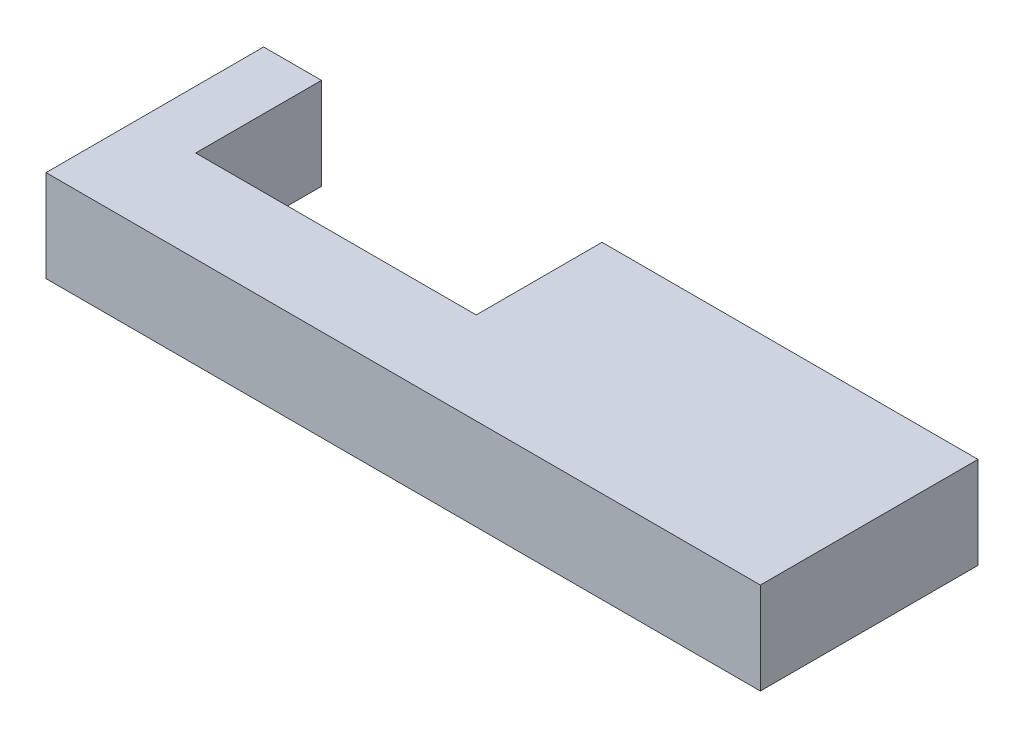
ISO-10303-21;
HEADER;
FILE_DESCRIPTION(('STEP AP214'),'2;1');
FILE_NAME('part.step','',(''),(''),'','','');
FILE_SCHEMA(('AUTOMOTIVE_DESIGN { 1 0 10303 214 1 1 1 1 }'));
ENDSEC;
DATA;
#1=APPLICATION_CONTEXT('core data for automotive mechanical design processes');
#2=APPLICATION_PROTOCOL_DEFINITION('international standard','automotive_design',2000,#1);
#3=PRODUCT_CONTEXT('',#1,'mechanical');
#4=PRODUCT('Part','Part','',(#3));
#5=PRODUCT_RELATED_PRODUCT_CATEGORY('part','',(#4));
#6=PRODUCT_DEFINITION_FORMATION('','',#4);
#7=PRODUCT_DEFINITION_CONTEXT('part definition',#1,'design');
#8=PRODUCT_DEFINITION('design','',#6,#7);
#9=PRODUCT_DEFINITION_SHAPE('','',#8);
#10=(LENGTH_UNIT() NAMED_UNIT(*) SI_UNIT(.MILLI.,.METRE.));
#11=(NAMED_UNIT(*) PLANE_ANGLE_UNIT() SI_UNIT($,.RADIAN.));
#12=(NAMED_UNIT(*) SI_UNIT($,.STERADIAN.) SOLID_ANGLE_UNIT());
#13=UNCERTAINTY_MEASURE_WITH_UNIT(LENGTH_MEASURE(1.E-05),#10,'distance_accuracy_value','');
#14=(GEOMETRIC_REPRESENTATION_CONTEXT(3) GLOBAL_UNCERTAINTY_ASSIGNED_CONTEXT((#13)) GLOBAL_UNIT_ASSIGNED_CONTEXT((#10,
#11,#12)) REPRESENTATION_CONTEXT('',''));
#15=CARTESIAN_POINT('',(0.,0.,0.));
#16=DIRECTION('',(0.,0.,1.));
#17=DIRECTION('',(1.,0.,0.));
#18=AXIS2_PLACEMENT_3D('',#15,#16,#17);
#19=CARTESIAN_POINT('',(0.,6.35,0.));
#20=DIRECTION('',(-1.,0.,0.));
#21=DIRECTION('',(0.,0.,1.));
#22=AXIS2_PLACEMENT_3D('',#19,#20,#21);
#23=PLANE('',#22);
#24=DIRECTION('',(0.,0.,-1.));
#25=VECTOR('',#24,1.);
#26=CARTESIAN_POINT('',(0.,0.,0.));
#27=LINE('',#26,#25);
#28=CARTESIAN_POINT('',(0.,0.,0.));
#29=VERTEX_POINT('',#28);
#30=CARTESIAN_POINT('',(0.,0.,-8.7));
#31=VERTEX_POINT('',#30);
#32=EDGE_CURVE('E124',#29,#31,#27,.T.);
#33=ORIENTED_EDGE('',*,*,#32,.T.);
#34=DIRECTION('',(0.,-1.,0.));
#35=VECTOR('',#34,1.);
#36=CARTESIAN_POINT('',(0.,6.35,-8.7));
#37=LINE('',#36,#35);
#38=CARTESIAN_POINT('',(0.,6.35,-8.7));
#39=VERTEX_POINT('',#38);
#40=EDGE_CURVE('E11',#39,#31,#37,.T.);
#41=ORIENTED_EDGE('',*,*,#40,.F.);
#42=DIRECTION('',(0.,0.,-1.));
#43=VECTOR('',#42,1.);
#44=CARTESIAN_POINT('',(0.,6.35,0.));
#45=LINE('',#44,#43);
#46=CARTESIAN_POINT('',(0.,6.35,0.));
#47=VERTEX_POINT('',#46);
#48=EDGE_CURVE('E138',#47,#39,#45,.T.);
#49=ORIENTED_EDGE('',*,*,#48,.F.);
#50=DIRECTION('',(0.,-1.,0.));
#51=VECTOR('',#50,1.);
#52=CARTESIAN_POINT('',(0.,6.35,0.));
#53=LINE('',#52,#51);
#54=EDGE_CURVE('E120',#47,#29,#53,.T.);
#55=ORIENTED_EDGE('',*,*,#54,.T.);
#56=EDGE_LOOP('',(#33,#41,#49,#55));
#57=FACE_BOUND('',#56,.T.);
#58=ADVANCED_FACE('F33',(#57),#23,.F.);
#59=CARTESIAN_POINT('',(0.,6.35,-8.7));
#60=DIRECTION('',(0.,0.,1.));
#61=DIRECTION('',(1.,0.,0.));
#62=AXIS2_PLACEMENT_3D('',#59,#60,#61);
#63=PLANE('',#62);
#64=DIRECTION('',(-1.,0.,0.));
#65=VECTOR('',#64,1.);
#66=CARTESIAN_POINT('',(0.,0.,-8.7));
#67=LINE('',#66,#65);
#68=CARTESIAN_POINT('',(-4.,0.,-8.69999999999999));
#69=VERTEX_POINT('',#68);
#70=EDGE_CURVE('E127',#31,#69,#67,.T.);
#71=ORIENTED_EDGE('',*,*,#70,.T.);
#72=DIRECTION('',(0.,-1.,0.));
#73=VECTOR('',#72,1.);
#74=CARTESIAN_POINT('',(-4.,6.35,-8.69999999999999));
#75=LINE('',#74,#73);
#76=CARTESIAN_POINT('',(-4.,6.35,-8.69999999999999));
#77=VERTEX_POINT('',#76);
#78=EDGE_CURVE('E41',#77,#69,#75,.T.);
#79=ORIENTED_EDGE('',*,*,#78,.F.);
#80=DIRECTION('',(-1.,0.,0.));
#81=VECTOR('',#80,1.);
#82=CARTESIAN_POINT('',(0.,6.35,-8.7));
#83=LINE('',#82,#81);
#84=EDGE_CURVE('E87',#39,#77,#83,.T.);
#85=ORIENTED_EDGE('',*,*,#84,.F.);
#86=ORIENTED_EDGE('',*,*,#40,.T.);
#87=EDGE_LOOP('',(#71,#79,#85,#86));
#88=FACE_BOUND('',#87,.T.);
#89=ADVANCED_FACE('F178',(#88),#63,.F.);
#90=CARTESIAN_POINT('',(-4.,6.35,-8.69999999999999));
#91=DIRECTION('',(1.,0.,0.));
#92=DIRECTION('',(0.,0.,-1.));
#93=AXIS2_PLACEMENT_3D('',#90,#91,#92);
#94=PLANE('',#93);
#95=DIRECTION('',(0.,0.,1.));
#96=VECTOR('',#95,1.);
#97=CARTESIAN_POINT('',(-4.,0.,-8.69999999999999));
#98=LINE('',#97,#96);
#99=CARTESIAN_POINT('',(-4.,0.,6.35));
#100=VERTEX_POINT('',#99);
#101=EDGE_CURVE('E130',#69,#100,#98,.T.);
#102=ORIENTED_EDGE('',*,*,#101,.T.);
#103=DIRECTION('',(0.,-1.,0.));
#104=VECTOR('',#103,1.);
#105=CARTESIAN_POINT('',(-4.,6.35,6.35));
#106=LINE('',#105,#104);
#107=CARTESIAN_POINT('',(-4.,6.35,6.35));
#108=VERTEX_POINT('',#107);
#109=EDGE_CURVE('E115',#108,#100,#106,.T.);
#110=ORIENTED_EDGE('',*,*,#109,.F.);
#111=DIRECTION('',(0.,0.,1.));
#112=VECTOR('',#111,1.);
#113=CARTESIAN_POINT('',(-4.,6.35,-8.69999999999999));
#114=LINE('',#113,#112);
#115=EDGE_CURVE('E148',#77,#108,#114,.T.);
#116=ORIENTED_EDGE('',*,*,#115,.F.);
#117=ORIENTED_EDGE('',*,*,#78,.T.);
#118=EDGE_LOOP('',(#102,#110,#116,#117));
#119=FACE_BOUND('',#118,.T.);
#120=ADVANCED_FACE('F146',(#119),#94,.F.);
#121=CARTESIAN_POINT('',(23.4,6.35,6.35));
#122=DIRECTION('',(0.,0.,-1.));
#123=DIRECTION('',(-1.,0.,0.));
#124=AXIS2_PLACEMENT_3D('',#121,#122,#123);
#125=PLANE('',#124);
#126=DIRECTION('',(1.,0.,0.));
#127=VECTOR('',#126,1.);
#128=CARTESIAN_POINT('',(23.4,0.,6.35));
#129=LINE('',#128,#127);
#130=CARTESIAN_POINT('',(45.4,0.,6.35));
#131=VERTEX_POINT('',#130);
#132=EDGE_CURVE('E132',#100,#131,#129,.T.);
#133=ORIENTED_EDGE('',*,*,#132,.T.);
#134=DIRECTION('',(0.,-1.,0.));
#135=VECTOR('',#134,1.);
#136=CARTESIAN_POINT('',(45.4,6.35,6.35));
#137=LINE('',#136,#135);
#138=CARTESIAN_POINT('',(45.4,6.35,6.35));
#139=VERTEX_POINT('',#138);
#140=EDGE_CURVE('E162',#139,#131,#137,.T.);
#141=ORIENTED_EDGE('',*,*,#140,.F.);
#142=DIRECTION('',(1.,0.,0.));
#143=VECTOR('',#142,1.);
#144=CARTESIAN_POINT('',(23.4,6.35,6.35));
#145=LINE('',#144,#143);
#146=EDGE_CURVE('E109',#108,#139,#145,.T.);
#147=ORIENTED_EDGE('',*,*,#146,.F.);
#148=ORIENTED_EDGE('',*,*,#109,.T.);
#149=EDGE_LOOP('',(#133,#141,#147,#148));
#150=FACE_BOUND('',#149,.T.);
#151=ADVANCED_FACE('F159',(#150),#125,.F.);
#152=CARTESIAN_POINT('',(19.4,6.35,-8.7));
#153=DIRECTION('',(0.,0.,1.));
#154=DIRECTION('',(1.,0.,0.));
#155=AXIS2_PLACEMENT_3D('',#152,#153,#154);
#156=PLANE('',#155);
#157=DIRECTION('',(-1.,0.,0.));
#158=VECTOR('',#157,1.);
#159=CARTESIAN_POINT('',(19.4,0.,-8.7));
#160=LINE('',#159,#158);
#161=CARTESIAN_POINT('',(45.4,0.,-8.7));
#162=VERTEX_POINT('',#161);
#163=CARTESIAN_POINT('',(19.4,0.,-8.7));
#164=VERTEX_POINT('',#163);
#165=EDGE_CURVE('E114',#162,#164,#160,.T.);
#166=ORIENTED_EDGE('',*,*,#165,.T.);
#167=DIRECTION('',(0.,-1.,0.));
#168=VECTOR('',#167,1.);
#169=CARTESIAN_POINT('',(19.4,6.35,-8.7));
#170=LINE('',#169,#168);
#171=CARTESIAN_POINT('',(19.4,6.35,-8.7));
#172=VERTEX_POINT('',#171);
#173=EDGE_CURVE('E111',#172,#164,#170,.T.);
#174=ORIENTED_EDGE('',*,*,#173,.F.);
#175=DIRECTION('',(-1.,0.,0.));
#176=VECTOR('',#175,1.);
#177=CARTESIAN_POINT('',(19.4,6.35,-8.7));
#178=LINE('',#177,#176);
#179=CARTESIAN_POINT('',(45.4,6.35,-8.7));
#180=VERTEX_POINT('',#179);
#181=EDGE_CURVE('E97',#180,#172,#178,.T.);
#182=ORIENTED_EDGE('',*,*,#181,.F.);
#183=DIRECTION('',(0.,1.,0.));
#184=VECTOR('',#183,1.);
#185=CARTESIAN_POINT('',(45.4,6.35,-8.7));
#186=LINE('',#185,#184);
#187=EDGE_CURVE('E167',#162,#180,#186,.T.);
#188=ORIENTED_EDGE('',*,*,#187,.F.);
#189=EDGE_LOOP('',(#166,#174,#182,#188));
#190=FACE_BOUND('',#189,.T.);
#191=ADVANCED_FACE('F112',(#190),#156,.F.);
#192=CARTESIAN_POINT('',(19.4,6.35,0.));
#193=DIRECTION('',(1.,0.,0.));
#194=DIRECTION('',(0.,0.,-1.));
#195=AXIS2_PLACEMENT_3D('',#192,#193,#194);
#196=PLANE('',#195);
#197=DIRECTION('',(0.,0.,1.));
#198=VECTOR('',#197,1.);
#199=CARTESIAN_POINT('',(19.4,0.,0.));
#200=LINE('',#199,#198);
#201=CARTESIAN_POINT('',(19.4,0.,0.));
#202=VERTEX_POINT('',#201);
#203=EDGE_CURVE('E73',#164,#202,#200,.T.);
#204=ORIENTED_EDGE('',*,*,#203,.T.);
#205=DIRECTION('',(0.,-1.,0.));
#206=VECTOR('',#205,1.);
#207=CARTESIAN_POINT('',(19.4,6.35,0.));
#208=LINE('',#207,#206);
#209=CARTESIAN_POINT('',(19.4,6.35,0.));
#210=VERTEX_POINT('',#209);
#211=EDGE_CURVE('E116',#210,#202,#208,.T.);
#212=ORIENTED_EDGE('',*,*,#211,.F.);
#213=DIRECTION('',(0.,0.,1.));
#214=VECTOR('',#213,1.);
#215=CARTESIAN_POINT('',(19.4,6.35,0.));
#216=LINE('',#215,#214);
#217=EDGE_CURVE('E101',#172,#210,#216,.T.);
#218=ORIENTED_EDGE('',*,*,#217,.F.);
#219=ORIENTED_EDGE('',*,*,#173,.T.);
#220=EDGE_LOOP('',(#204,#212,#218,#219));
#221=FACE_BOUND('',#220,.T.);
#222=ADVANCED_FACE('F118',(#221),#196,.F.);
#223=CARTESIAN_POINT('',(0.,6.35,0.));
#224=DIRECTION('',(0.,0.,1.));
#225=DIRECTION('',(1.,0.,0.));
#226=AXIS2_PLACEMENT_3D('',#223,#224,#225);
#227=PLANE('',#226);
#228=DIRECTION('',(-1.,0.,0.));
#229=VECTOR('',#228,1.);
#230=CARTESIAN_POINT('',(0.,0.,0.));
#231=LINE('',#230,#229);
#232=EDGE_CURVE('E79',#202,#29,#231,.T.);
#233=ORIENTED_EDGE('',*,*,#232,.T.);
#234=ORIENTED_EDGE('',*,*,#54,.F.);
#235=DIRECTION('',(-1.,0.,0.));
#236=VECTOR('',#235,1.);
#237=CARTESIAN_POINT('',(0.,6.35,0.));
#238=LINE('',#237,#236);
#239=EDGE_CURVE('E49',#210,#47,#238,.T.);
#240=ORIENTED_EDGE('',*,*,#239,.F.);
#241=ORIENTED_EDGE('',*,*,#211,.T.);
#242=EDGE_LOOP('',(#233,#234,#240,#241));
#243=FACE_BOUND('',#242,.T.);
#244=ADVANCED_FACE('F192',(#243),#227,.F.);
#245=CARTESIAN_POINT('',(0.,6.35,0.));
#246=DIRECTION('',(0.,1.,0.));
#247=DIRECTION('',(0.,0.,1.));
#248=AXIS2_PLACEMENT_3D('',#245,#246,#247);
#249=PLANE('',#248);
#250=ORIENTED_EDGE('',*,*,#48,.T.);
#251=ORIENTED_EDGE('',*,*,#84,.T.);
#252=ORIENTED_EDGE('',*,*,#115,.T.);
#253=ORIENTED_EDGE('',*,*,#146,.T.);
#254=DIRECTION('',(0.,0.,1.));
#255=VECTOR('',#254,1.);
#256=CARTESIAN_POINT('',(45.4,6.35,-8.7));
#257=LINE('',#256,#255);
#258=EDGE_CURVE('E105',#180,#139,#257,.T.);
#259=ORIENTED_EDGE('',*,*,#258,.F.);
#260=ORIENTED_EDGE('',*,*,#181,.T.);
#261=ORIENTED_EDGE('',*,*,#217,.T.);
#262=ORIENTED_EDGE('',*,*,#239,.T.);
#263=EDGE_LOOP('',(#250,#251,#252,#253,#259,#260,#261,#262));
#264=FACE_BOUND('',#263,.T.);
#265=ADVANCED_FACE('F99',(#264),#249,.T.);
#266=CARTESIAN_POINT('',(0.,0.,0.));
#267=DIRECTION('',(0.,1.,0.));
#268=DIRECTION('',(0.,0.,1.));
#269=AXIS2_PLACEMENT_3D('',#266,#267,#268);
#270=PLANE('',#269);
#271=ORIENTED_EDGE('',*,*,#32,.F.);
#272=ORIENTED_EDGE('',*,*,#232,.F.);
#273=ORIENTED_EDGE('',*,*,#203,.F.);
#274=ORIENTED_EDGE('',*,*,#165,.F.);
#275=DIRECTION('',(0.,0.,-1.));
#276=VECTOR('',#275,1.);
#277=CARTESIAN_POINT('',(45.4,0.,-8.7));
#278=LINE('',#277,#276);
#279=EDGE_CURVE('E128',#131,#162,#278,.T.);
#280=ORIENTED_EDGE('',*,*,#279,.F.);
#281=ORIENTED_EDGE('',*,*,#132,.F.);
#282=ORIENTED_EDGE('',*,*,#101,.F.);
#283=ORIENTED_EDGE('',*,*,#70,.F.);
#284=EDGE_LOOP('',(#271,#272,#273,#274,#280,#281,#282,#283));
#285=FACE_BOUND('',#284,.T.);
#286=ADVANCED_FACE('F152',(#285),#270,.F.);
#287=CARTESIAN_POINT('',(45.4,0.,0.));
#288=DIRECTION('',(-1.,0.,0.));
#289=DIRECTION('',(0.,0.,1.));
#290=AXIS2_PLACEMENT_3D('',#287,#288,#289);
#291=PLANE('',#290);
#292=ORIENTED_EDGE('',*,*,#187,.T.);
#293=ORIENTED_EDGE('',*,*,#258,.T.);
#294=ORIENTED_EDGE('',*,*,#140,.T.);
#295=ORIENTED_EDGE('',*,*,#279,.T.);
#296=EDGE_LOOP('',(#292,#293,#294,#295));
#297=FACE_BOUND('',#296,.T.);
#298=ADVANCED_FACE('F164',(#297),#291,.F.);
#299=CLOSED_SHELL('',(#58,#89,#120,#151,#191,#222,#244,#265,#286,#298));
#300=MANIFOLD_SOLID_BREP('B2',#299);
#301=ADVANCED_BREP_SHAPE_REPRESENTATION('',(#18,#300),#14);
#302=SHAPE_DEFINITION_REPRESENTATION(#9,#301);
ENDSEC;
END-ISO-10303-21;
